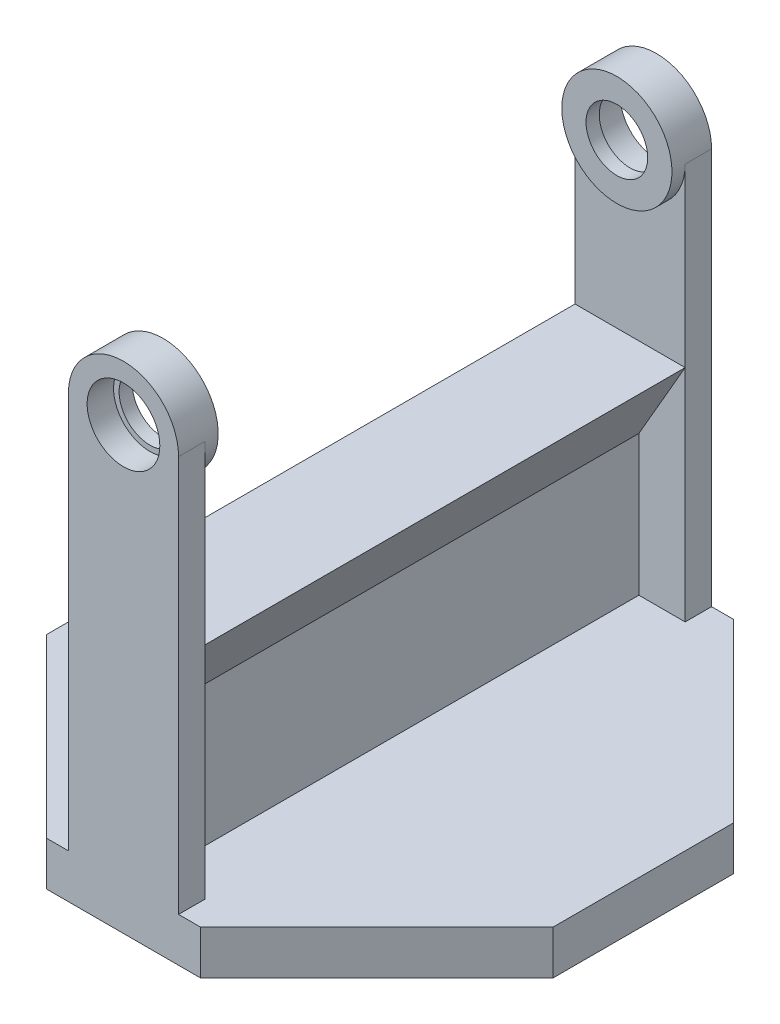
ISO-10303-21;
HEADER;
FILE_DESCRIPTION(('STEP AP214'),'2;1');
FILE_NAME('part.step','',(''),(''),'','','');
FILE_SCHEMA(('AUTOMOTIVE_DESIGN { 1 0 10303 214 1 1 1 1 }'));
ENDSEC;
DATA;
#1=APPLICATION_CONTEXT('core data for automotive mechanical design processes');
#2=APPLICATION_PROTOCOL_DEFINITION('international standard','automotive_design',2000,#1);
#3=PRODUCT_CONTEXT('',#1,'mechanical');
#4=PRODUCT('Part','Part','',(#3));
#5=PRODUCT_RELATED_PRODUCT_CATEGORY('part','',(#4));
#6=PRODUCT_DEFINITION_FORMATION('','',#4);
#7=PRODUCT_DEFINITION_CONTEXT('part definition',#1,'design');
#8=PRODUCT_DEFINITION('design','',#6,#7);
#9=PRODUCT_DEFINITION_SHAPE('','',#8);
#10=(LENGTH_UNIT() NAMED_UNIT(*) SI_UNIT(.MILLI.,.METRE.));
#11=(NAMED_UNIT(*) PLANE_ANGLE_UNIT() SI_UNIT($,.RADIAN.));
#12=(NAMED_UNIT(*) SI_UNIT($,.STERADIAN.) SOLID_ANGLE_UNIT());
#13=UNCERTAINTY_MEASURE_WITH_UNIT(LENGTH_MEASURE(1.E-05),#10,'distance_accuracy_value','');
#14=(GEOMETRIC_REPRESENTATION_CONTEXT(3) GLOBAL_UNCERTAINTY_ASSIGNED_CONTEXT((#13)) GLOBAL_UNIT_ASSIGNED_CONTEXT((#10,
#11,#12)) REPRESENTATION_CONTEXT('',''));
#15=CARTESIAN_POINT('',(0.,0.,0.));
#16=DIRECTION('',(0.,0.,1.));
#17=DIRECTION('',(1.,0.,0.));
#18=AXIS2_PLACEMENT_3D('',#15,#16,#17);
#19=CARTESIAN_POINT('',(0.,100.,54.5));
#20=DIRECTION('',(0.,0.,1.));
#21=DIRECTION('',(1.,0.,0.));
#22=AXIS2_PLACEMENT_3D('',#19,#20,#21);
#23=PLANE('',#22);
#24=DIRECTION('',(0.500000000000001,-0.866025403784438,0.));
#25=VECTOR('',#24,1.);
#26=CARTESIAN_POINT('',(-12.5,60.,54.5));
#27=LINE('',#26,#25);
#28=CARTESIAN_POINT('',(-12.5,60.,54.5));
#29=VERTEX_POINT('',#28);
#30=CARTESIAN_POINT('',(-1.99999999999997,41.8134665205268,54.5));
#31=VERTEX_POINT('',#30);
#32=EDGE_CURVE('E201',#29,#31,#27,.T.);
#33=ORIENTED_EDGE('',*,*,#32,.T.);
#34=DIRECTION('',(0.,-1.,0.));
#35=VECTOR('',#34,1.);
#36=CARTESIAN_POINT('',(-2.,10.,54.5));
#37=LINE('',#36,#35);
#38=CARTESIAN_POINT('',(-2.,10.,54.5));
#39=VERTEX_POINT('',#38);
#40=EDGE_CURVE('E214',#31,#39,#37,.T.);
#41=ORIENTED_EDGE('',*,*,#40,.T.);
#42=DIRECTION('',(-1.,0.,0.));
#43=VECTOR('',#42,1.);
#44=CARTESIAN_POINT('',(0.,10.,54.5));
#45=LINE('',#44,#43);
#46=CARTESIAN_POINT('',(-12.5,10.,54.5));
#47=VERTEX_POINT('',#46);
#48=EDGE_CURVE('E282',#39,#47,#45,.T.);
#49=ORIENTED_EDGE('',*,*,#48,.T.);
#50=DIRECTION('',(0.,-1.,0.));
#51=VECTOR('',#50,1.);
#52=CARTESIAN_POINT('',(-12.5,100.,54.5));
#53=LINE('',#52,#51);
#54=EDGE_CURVE('E216',#29,#47,#53,.T.);
#55=ORIENTED_EDGE('',*,*,#54,.F.);
#56=EDGE_LOOP('',(#33,#41,#49,#55));
#57=FACE_BOUND('',#56,.T.);
#58=ADVANCED_FACE('F46',(#57),#23,.F.);
#59=DIRECTION('',(1.,0.,0.));
#60=VECTOR('',#59,1.);
#61=CARTESIAN_POINT('',(-2.,60.,54.5));
#62=LINE('',#61,#60);
#63=CARTESIAN_POINT('',(12.5,60.,54.5));
#64=VERTEX_POINT('',#63);
#65=EDGE_CURVE('E225',#29,#64,#62,.T.);
#66=ORIENTED_EDGE('',*,*,#65,.F.);
#67=CARTESIAN_POINT('',(-12.5,100.,54.5));
#68=VERTEX_POINT('',#67);
#69=EDGE_CURVE('E259',#68,#29,#53,.T.);
#70=ORIENTED_EDGE('',*,*,#69,.F.);
#71=CARTESIAN_POINT('',(0.,100.,54.5));
#72=DIRECTION('',(0.,0.,-1.));
#73=DIRECTION('',(-1.,0.,0.));
#74=AXIS2_PLACEMENT_3D('',#71,#72,#73);
#75=CIRCLE('',#74,12.5);
#76=CARTESIAN_POINT('',(12.5,100.,54.5));
#77=VERTEX_POINT('',#76);
#78=EDGE_CURVE('E248',#77,#68,#75,.T.);
#79=ORIENTED_EDGE('',*,*,#78,.F.);
#80=DIRECTION('',(0.,1.,0.));
#81=VECTOR('',#80,1.);
#82=CARTESIAN_POINT('',(12.5,100.,54.5));
#83=LINE('',#82,#81);
#84=EDGE_CURVE('E262',#64,#77,#83,.T.);
#85=ORIENTED_EDGE('',*,*,#84,.F.);
#86=EDGE_LOOP('',(#66,#70,#79,#85));
#87=FACE_BOUND('',#86,.T.);
#88=ADVANCED_FACE('F670',(#87),#23,.F.);
#89=CARTESIAN_POINT('',(0.,100.,-54.5));
#90=DIRECTION('',(0.,0.,-1.));
#91=DIRECTION('',(1.,0.,0.));
#92=AXIS2_PLACEMENT_3D('',#89,#90,#91);
#93=PLANE('',#92);
#94=DIRECTION('',(0.500000000000001,-0.866025403784438,0.));
#95=VECTOR('',#94,1.);
#96=CARTESIAN_POINT('',(-12.5,60.,-54.5));
#97=LINE('',#96,#95);
#98=CARTESIAN_POINT('',(-12.5,60.,-54.5));
#99=VERTEX_POINT('',#98);
#100=CARTESIAN_POINT('',(-1.99999999999997,41.8134665205268,-54.5));
#101=VERTEX_POINT('',#100);
#102=EDGE_CURVE('E204',#99,#101,#97,.T.);
#103=ORIENTED_EDGE('',*,*,#102,.F.);
#104=DIRECTION('',(0.,-1.,0.));
#105=VECTOR('',#104,1.);
#106=CARTESIAN_POINT('',(-12.5,100.,-54.5));
#107=LINE('',#106,#105);
#108=CARTESIAN_POINT('',(-12.5,10.,-54.5));
#109=VERTEX_POINT('',#108);
#110=EDGE_CURVE('E539',#99,#109,#107,.T.);
#111=ORIENTED_EDGE('',*,*,#110,.T.);
#112=DIRECTION('',(1.,0.,0.));
#113=VECTOR('',#112,1.);
#114=CARTESIAN_POINT('',(0.,10.,-54.5));
#115=LINE('',#114,#113);
#116=CARTESIAN_POINT('',(-2.,10.,-54.5));
#117=VERTEX_POINT('',#116);
#118=EDGE_CURVE('E511',#109,#117,#115,.T.);
#119=ORIENTED_EDGE('',*,*,#118,.T.);
#120=DIRECTION('',(0.,-1.,0.));
#121=VECTOR('',#120,1.);
#122=CARTESIAN_POINT('',(-2.,10.,-54.5));
#123=LINE('',#122,#121);
#124=EDGE_CURVE('E601',#101,#117,#123,.T.);
#125=ORIENTED_EDGE('',*,*,#124,.F.);
#126=EDGE_LOOP('',(#103,#111,#119,#125));
#127=FACE_BOUND('',#126,.T.);
#128=ADVANCED_FACE('F649',(#127),#93,.F.);
#129=CARTESIAN_POINT('',(-12.5,100.,-54.5));
#130=VERTEX_POINT('',#129);
#131=EDGE_CURVE('E533',#130,#99,#107,.T.);
#132=ORIENTED_EDGE('',*,*,#131,.T.);
#133=DIRECTION('',(1.,0.,0.));
#134=VECTOR('',#133,1.);
#135=CARTESIAN_POINT('',(-2.,60.,-54.5));
#136=LINE('',#135,#134);
#137=CARTESIAN_POINT('',(12.5,60.,-54.5));
#138=VERTEX_POINT('',#137);
#139=EDGE_CURVE('E596',#99,#138,#136,.T.);
#140=ORIENTED_EDGE('',*,*,#139,.T.);
#141=DIRECTION('',(0.,1.,0.));
#142=VECTOR('',#141,1.);
#143=CARTESIAN_POINT('',(12.5,100.,-54.5));
#144=LINE('',#143,#142);
#145=CARTESIAN_POINT('',(12.5,100.,-54.5));
#146=VERTEX_POINT('',#145);
#147=EDGE_CURVE('E547',#138,#146,#144,.T.);
#148=ORIENTED_EDGE('',*,*,#147,.T.);
#149=CARTESIAN_POINT('',(0.,100.,-54.5));
#150=DIRECTION('',(0.,0.,-1.));
#151=DIRECTION('',(-1.,0.,0.));
#152=AXIS2_PLACEMENT_3D('',#149,#150,#151);
#153=CIRCLE('',#152,12.5);
#154=EDGE_CURVE('E572',#146,#130,#153,.T.);
#155=ORIENTED_EDGE('',*,*,#154,.T.);
#156=EDGE_LOOP('',(#132,#140,#148,#155));
#157=FACE_BOUND('',#156,.T.);
#158=ADVANCED_FACE('F656',(#157),#93,.F.);
#159=CARTESIAN_POINT('',(-2.,0.,0.));
#160=DIRECTION('',(-1.,0.,0.));
#161=DIRECTION('',(0.,0.,1.));
#162=AXIS2_PLACEMENT_3D('',#159,#160,#161);
#163=PLANE('',#162);
#164=ORIENTED_EDGE('',*,*,#40,.F.);
#165=DIRECTION('',(0.,0.,-1.));
#166=VECTOR('',#165,1.);
#167=CARTESIAN_POINT('',(-1.99999999999997,41.8134665205268,60.502));
#168=LINE('',#167,#166);
#169=EDGE_CURVE('E197',#31,#101,#168,.T.);
#170=ORIENTED_EDGE('',*,*,#169,.T.);
#171=ORIENTED_EDGE('',*,*,#124,.T.);
#172=DIRECTION('',(0.,0.,-1.));
#173=VECTOR('',#172,1.);
#174=CARTESIAN_POINT('',(-2.,10.,0.));
#175=LINE('',#174,#173);
#176=EDGE_CURVE('E223',#39,#117,#175,.T.);
#177=ORIENTED_EDGE('',*,*,#176,.F.);
#178=EDGE_LOOP('',(#164,#170,#171,#177));
#179=FACE_BOUND('',#178,.T.);
#180=ADVANCED_FACE('F221',(#179),#163,.T.);
#181=DIRECTION('',(0.500000000000001,0.866025403784438,0.));
#182=VECTOR('',#181,1.);
#183=CARTESIAN_POINT('',(12.5,60.,54.5));
#184=LINE('',#183,#182);
#185=CARTESIAN_POINT('',(2.,41.8134665205268,54.5));
#186=VERTEX_POINT('',#185);
#187=EDGE_CURVE('E628',#186,#64,#184,.T.);
#188=ORIENTED_EDGE('',*,*,#187,.T.);
#189=CARTESIAN_POINT('',(12.5,10.,54.5));
#190=VERTEX_POINT('',#189);
#191=EDGE_CURVE('E263',#190,#64,#83,.T.);
#192=ORIENTED_EDGE('',*,*,#191,.F.);
#193=CARTESIAN_POINT('',(2.,10.,54.5));
#194=VERTEX_POINT('',#193);
#195=EDGE_CURVE('E285',#190,#194,#45,.T.);
#196=ORIENTED_EDGE('',*,*,#195,.T.);
#197=DIRECTION('',(0.,-1.,0.));
#198=VECTOR('',#197,1.);
#199=CARTESIAN_POINT('',(2.,10.,54.5));
#200=LINE('',#199,#198);
#201=EDGE_CURVE('E232',#186,#194,#200,.T.);
#202=ORIENTED_EDGE('',*,*,#201,.F.);
#203=EDGE_LOOP('',(#188,#192,#196,#202));
#204=FACE_BOUND('',#203,.T.);
#205=ADVANCED_FACE('F679',(#204),#23,.F.);
#206=CARTESIAN_POINT('',(2.,0.,0.));
#207=DIRECTION('',(-1.,0.,0.));
#208=DIRECTION('',(0.,0.,1.));
#209=AXIS2_PLACEMENT_3D('',#206,#207,#208);
#210=PLANE('',#209);
#211=DIRECTION('',(0.,0.,-1.));
#212=VECTOR('',#211,1.);
#213=CARTESIAN_POINT('',(2.,41.8134665205268,60.502));
#214=LINE('',#213,#212);
#215=CARTESIAN_POINT('',(2.,41.8134665205268,-54.5));
#216=VERTEX_POINT('',#215);
#217=EDGE_CURVE('E622',#186,#216,#214,.T.);
#218=ORIENTED_EDGE('',*,*,#217,.F.);
#219=ORIENTED_EDGE('',*,*,#201,.T.);
#220=DIRECTION('',(0.,0.,-1.));
#221=VECTOR('',#220,1.);
#222=CARTESIAN_POINT('',(2.,10.,0.));
#223=LINE('',#222,#221);
#224=CARTESIAN_POINT('',(2.,10.,-54.5));
#225=VERTEX_POINT('',#224);
#226=EDGE_CURVE('E494',#194,#225,#223,.T.);
#227=ORIENTED_EDGE('',*,*,#226,.T.);
#228=DIRECTION('',(0.,-1.,0.));
#229=VECTOR('',#228,1.);
#230=CARTESIAN_POINT('',(2.,10.,-54.5));
#231=LINE('',#230,#229);
#232=EDGE_CURVE('E605',#216,#225,#231,.T.);
#233=ORIENTED_EDGE('',*,*,#232,.F.);
#234=EDGE_LOOP('',(#218,#219,#227,#233));
#235=FACE_BOUND('',#234,.T.);
#236=ADVANCED_FACE('F687',(#235),#210,.F.);
#237=DIRECTION('',(0.500000000000001,0.866025403784438,0.));
#238=VECTOR('',#237,1.);
#239=CARTESIAN_POINT('',(12.5,60.,-54.5));
#240=LINE('',#239,#238);
#241=EDGE_CURVE('E609',#216,#138,#240,.T.);
#242=ORIENTED_EDGE('',*,*,#241,.F.);
#243=ORIENTED_EDGE('',*,*,#232,.T.);
#244=CARTESIAN_POINT('',(12.5,10.,-54.5));
#245=VERTEX_POINT('',#244);
#246=EDGE_CURVE('E517',#225,#245,#115,.T.);
#247=ORIENTED_EDGE('',*,*,#246,.T.);
#248=EDGE_CURVE('E542',#245,#138,#144,.T.);
#249=ORIENTED_EDGE('',*,*,#248,.T.);
#250=EDGE_LOOP('',(#242,#243,#247,#249));
#251=FACE_BOUND('',#250,.T.);
#252=ADVANCED_FACE('F684',(#251),#93,.F.);
#253=CARTESIAN_POINT('',(0.,10.,0.));
#254=DIRECTION('',(0.,-1.,0.));
#255=DIRECTION('',(0.,0.,-1.));
#256=AXIS2_PLACEMENT_3D('',#253,#254,#255);
#257=PLANE('',#256);
#258=DIRECTION('',(0.,0.,-1.));
#259=VECTOR('',#258,1.);
#260=CARTESIAN_POINT('',(57.5,10.,60.5));
#261=LINE('',#260,#259);
#262=CARTESIAN_POINT('',(57.5,10.,20.5));
#263=VERTEX_POINT('',#262);
#264=CARTESIAN_POINT('',(57.5,10.,-20.4999999999999));
#265=VERTEX_POINT('',#264);
#266=EDGE_CURVE('E298',#263,#265,#261,.T.);
#267=ORIENTED_EDGE('',*,*,#266,.T.);
#268=DIRECTION('',(0.707106781186547,0.,0.707106781186548));
#269=VECTOR('',#268,1.);
#270=CARTESIAN_POINT('',(17.5,10.,-60.5));
#271=LINE('',#270,#269);
#272=CARTESIAN_POINT('',(17.5,10.,-60.5));
#273=VERTEX_POINT('',#272);
#274=EDGE_CURVE('E362',#265,#273,#271,.F.);
#275=ORIENTED_EDGE('',*,*,#274,.T.);
#276=DIRECTION('',(-1.,0.,0.));
#277=VECTOR('',#276,1.);
#278=CARTESIAN_POINT('',(-57.5,10.,-60.5));
#279=LINE('',#278,#277);
#280=CARTESIAN_POINT('',(12.5,10.,-60.5));
#281=VERTEX_POINT('',#280);
#282=EDGE_CURVE('E304',#273,#281,#279,.T.);
#283=ORIENTED_EDGE('',*,*,#282,.T.);
#284=DIRECTION('',(0.,0.,-1.));
#285=VECTOR('',#284,1.);
#286=CARTESIAN_POINT('',(12.5,10.,0.));
#287=LINE('',#286,#285);
#288=EDGE_CURVE('E505',#245,#281,#287,.T.);
#289=ORIENTED_EDGE('',*,*,#288,.F.);
#290=ORIENTED_EDGE('',*,*,#246,.F.);
#291=ORIENTED_EDGE('',*,*,#226,.F.);
#292=ORIENTED_EDGE('',*,*,#195,.F.);
#293=DIRECTION('',(0.,0.,1.));
#294=VECTOR('',#293,1.);
#295=CARTESIAN_POINT('',(12.5,10.,0.));
#296=LINE('',#295,#294);
#297=CARTESIAN_POINT('',(12.5,9.99999999999999,60.5));
#298=VERTEX_POINT('',#297);
#299=EDGE_CURVE('E293',#190,#298,#296,.T.);
#300=ORIENTED_EDGE('',*,*,#299,.T.);
#301=DIRECTION('',(1.,0.,0.));
#302=VECTOR('',#301,1.);
#303=CARTESIAN_POINT('',(-57.5,10.,60.5));
#304=LINE('',#303,#302);
#305=CARTESIAN_POINT('',(17.4999999999999,10.,60.5));
#306=VERTEX_POINT('',#305);
#307=EDGE_CURVE('E310',#298,#306,#304,.T.);
#308=ORIENTED_EDGE('',*,*,#307,.T.);
#309=DIRECTION('',(-0.707106781186548,0.,0.707106781186547));
#310=VECTOR('',#309,1.);
#311=CARTESIAN_POINT('',(57.5,10.,20.5));
#312=LINE('',#311,#310);
#313=EDGE_CURVE('E359',#306,#263,#312,.F.);
#314=ORIENTED_EDGE('',*,*,#313,.T.);
#315=EDGE_LOOP('',(#267,#275,#283,#289,#290,#291,#292,#300,#308,#314));
#316=FACE_BOUND('',#315,.T.);
#317=ADVANCED_FACE('F417',(#316),#257,.F.);
#318=CARTESIAN_POINT('',(-12.5,9.99999999999999,-60.5));
#319=VERTEX_POINT('',#318);
#320=CARTESIAN_POINT('',(-17.4999999999999,10.,-60.5));
#321=VERTEX_POINT('',#320);
#322=EDGE_CURVE('E302',#319,#321,#279,.T.);
#323=ORIENTED_EDGE('',*,*,#322,.T.);
#324=DIRECTION('',(0.707106781186548,0.,-0.707106781186547));
#325=VECTOR('',#324,1.);
#326=CARTESIAN_POINT('',(-57.5,10.,-20.5));
#327=LINE('',#326,#325);
#328=CARTESIAN_POINT('',(-57.5,10.,-20.5));
#329=VERTEX_POINT('',#328);
#330=EDGE_CURVE('E11',#321,#329,#327,.F.);
#331=ORIENTED_EDGE('',*,*,#330,.T.);
#332=DIRECTION('',(0.,0.,1.));
#333=VECTOR('',#332,1.);
#334=CARTESIAN_POINT('',(-57.5,10.,60.5));
#335=LINE('',#334,#333);
#336=CARTESIAN_POINT('',(-57.5,10.,20.4999999999999));
#337=VERTEX_POINT('',#336);
#338=EDGE_CURVE('E307',#329,#337,#335,.T.);
#339=ORIENTED_EDGE('',*,*,#338,.T.);
#340=DIRECTION('',(-0.707106781186547,0.,-0.707106781186548));
#341=VECTOR('',#340,1.);
#342=CARTESIAN_POINT('',(-17.5,10.,60.5));
#343=LINE('',#342,#341);
#344=CARTESIAN_POINT('',(-17.5,10.,60.5));
#345=VERTEX_POINT('',#344);
#346=EDGE_CURVE('E56',#337,#345,#343,.F.);
#347=ORIENTED_EDGE('',*,*,#346,.T.);
#348=CARTESIAN_POINT('',(-12.5,10.,60.5));
#349=VERTEX_POINT('',#348);
#350=EDGE_CURVE('E311',#345,#349,#304,.T.);
#351=ORIENTED_EDGE('',*,*,#350,.T.);
#352=DIRECTION('',(0.,0.,-1.));
#353=VECTOR('',#352,1.);
#354=CARTESIAN_POINT('',(-12.5,10.,0.));
#355=LINE('',#354,#353);
#356=EDGE_CURVE('E289',#349,#47,#355,.T.);
#357=ORIENTED_EDGE('',*,*,#356,.T.);
#358=ORIENTED_EDGE('',*,*,#48,.F.);
#359=ORIENTED_EDGE('',*,*,#176,.T.);
#360=ORIENTED_EDGE('',*,*,#118,.F.);
#361=DIRECTION('',(0.,0.,1.));
#362=VECTOR('',#361,1.);
#363=CARTESIAN_POINT('',(-12.5,10.,0.));
#364=LINE('',#363,#362);
#365=EDGE_CURVE('E499',#319,#109,#364,.T.);
#366=ORIENTED_EDGE('',*,*,#365,.F.);
#367=EDGE_LOOP('',(#323,#331,#339,#347,#351,#357,#358,#359,#360,#366));
#368=FACE_BOUND('',#367,.T.);
#369=ADVANCED_FACE('F380',(#368),#257,.F.);
#370=CARTESIAN_POINT('',(57.5,10.,60.5));
#371=DIRECTION('',(-1.,0.,0.));
#372=DIRECTION('',(0.,0.,1.));
#373=AXIS2_PLACEMENT_3D('',#370,#371,#372);
#374=PLANE('',#373);
#375=DIRECTION('',(0.,0.,-1.));
#376=VECTOR('',#375,1.);
#377=CARTESIAN_POINT('',(57.5,0.,60.5));
#378=LINE('',#377,#376);
#379=CARTESIAN_POINT('',(57.5,0.,20.5));
#380=VERTEX_POINT('',#379);
#381=CARTESIAN_POINT('',(57.5,0.,-20.4999999999999));
#382=VERTEX_POINT('',#381);
#383=EDGE_CURVE('E297',#380,#382,#378,.T.);
#384=ORIENTED_EDGE('',*,*,#383,.T.);
#385=DIRECTION('',(0.,1.,0.));
#386=VECTOR('',#385,1.);
#387=CARTESIAN_POINT('',(57.5,10.,-20.4999999999999));
#388=LINE('',#387,#386);
#389=EDGE_CURVE('E356',#382,#265,#388,.T.);
#390=ORIENTED_EDGE('',*,*,#389,.T.);
#391=ORIENTED_EDGE('',*,*,#266,.F.);
#392=DIRECTION('',(0.,-1.,0.));
#393=VECTOR('',#392,1.);
#394=CARTESIAN_POINT('',(57.5,10.,20.5));
#395=LINE('',#394,#393);
#396=EDGE_CURVE('E352',#263,#380,#395,.T.);
#397=ORIENTED_EDGE('',*,*,#396,.T.);
#398=EDGE_LOOP('',(#384,#390,#391,#397));
#399=FACE_BOUND('',#398,.T.);
#400=ADVANCED_FACE('F408',(#399),#374,.F.);
#401=CARTESIAN_POINT('',(-57.5,10.,-60.5));
#402=DIRECTION('',(0.,0.,1.));
#403=DIRECTION('',(1.,0.,0.));
#404=AXIS2_PLACEMENT_3D('',#401,#402,#403);
#405=PLANE('',#404);
#406=CARTESIAN_POINT('',(0.,100.,-60.5));
#407=DIRECTION('',(0.,0.,1.));
#408=DIRECTION('',(1.,0.,0.));
#409=AXIS2_PLACEMENT_3D('',#406,#407,#408);
#410=CIRCLE('',#409,8.25000000000001);
#411=CARTESIAN_POINT('',(8.25000000000001,100.,-60.5));
#412=VERTEX_POINT('',#411);
#413=EDGE_CURVE('E590',#412,#412,#410,.T.);
#414=ORIENTED_EDGE('',*,*,#413,.T.);
#415=EDGE_LOOP('',(#414));
#416=FACE_BOUND('',#415,.T.);
#417=ORIENTED_EDGE('',*,*,#282,.F.);
#418=DIRECTION('',(0.,-1.,0.));
#419=VECTOR('',#418,1.);
#420=CARTESIAN_POINT('',(17.5,10.,-60.5));
#421=LINE('',#420,#419);
#422=CARTESIAN_POINT('',(17.5,0.,-60.5));
#423=VERTEX_POINT('',#422);
#424=EDGE_CURVE('E336',#273,#423,#421,.T.);
#425=ORIENTED_EDGE('',*,*,#424,.T.);
#426=DIRECTION('',(-1.,0.,0.));
#427=VECTOR('',#426,1.);
#428=CARTESIAN_POINT('',(-57.5,0.,-60.5));
#429=LINE('',#428,#427);
#430=CARTESIAN_POINT('',(-17.4999999999999,0.,-60.5));
#431=VERTEX_POINT('',#430);
#432=EDGE_CURVE('E318',#423,#431,#429,.T.);
#433=ORIENTED_EDGE('',*,*,#432,.T.);
#434=DIRECTION('',(0.,1.,0.));
#435=VECTOR('',#434,1.);
#436=CARTESIAN_POINT('',(-17.4999999999999,10.,-60.5));
#437=LINE('',#436,#435);
#438=EDGE_CURVE('E314',#431,#321,#437,.T.);
#439=ORIENTED_EDGE('',*,*,#438,.T.);
#440=ORIENTED_EDGE('',*,*,#322,.F.);
#441=DIRECTION('',(0.,-1.,0.));
#442=VECTOR('',#441,1.);
#443=CARTESIAN_POINT('',(-12.5,100.,-60.5));
#444=LINE('',#443,#442);
#445=CARTESIAN_POINT('',(-12.5,100.,-60.5));
#446=VERTEX_POINT('',#445);
#447=EDGE_CURVE('E550',#446,#319,#444,.T.);
#448=ORIENTED_EDGE('',*,*,#447,.F.);
#449=CARTESIAN_POINT('',(0.,100.,-60.5));
#450=DIRECTION('',(0.,0.,1.));
#451=DIRECTION('',(1.,0.,0.));
#452=AXIS2_PLACEMENT_3D('',#449,#450,#451);
#453=CIRCLE('',#452,12.5);
#454=CARTESIAN_POINT('',(12.5,100.,-60.5));
#455=VERTEX_POINT('',#454);
#456=EDGE_CURVE('E560',#455,#446,#453,.T.);
#457=ORIENTED_EDGE('',*,*,#456,.F.);
#458=DIRECTION('',(0.,1.,0.));
#459=VECTOR('',#458,1.);
#460=CARTESIAN_POINT('',(12.5,100.,-60.5));
#461=LINE('',#460,#459);
#462=EDGE_CURVE('E555',#281,#455,#461,.T.);
#463=ORIENTED_EDGE('',*,*,#462,.F.);
#464=EDGE_LOOP('',(#417,#425,#433,#439,#440,#448,#457,#463));
#465=FACE_BOUND('',#464,.T.);
#466=ADVANCED_FACE('F399',(#416,#465),#405,.F.);
#467=CARTESIAN_POINT('',(-57.5,10.,60.5));
#468=DIRECTION('',(1.,0.,0.));
#469=DIRECTION('',(0.,0.,-1.));
#470=AXIS2_PLACEMENT_3D('',#467,#468,#469);
#471=PLANE('',#470);
#472=ORIENTED_EDGE('',*,*,#338,.F.);
#473=DIRECTION('',(0.,-1.,0.));
#474=VECTOR('',#473,1.);
#475=CARTESIAN_POINT('',(-57.5,10.,-20.5));
#476=LINE('',#475,#474);
#477=CARTESIAN_POINT('',(-57.5,0.,-20.5));
#478=VERTEX_POINT('',#477);
#479=EDGE_CURVE('E374',#329,#478,#476,.T.);
#480=ORIENTED_EDGE('',*,*,#479,.T.);
#481=DIRECTION('',(0.,0.,1.));
#482=VECTOR('',#481,1.);
#483=CARTESIAN_POINT('',(-57.5,0.,60.5));
#484=LINE('',#483,#482);
#485=CARTESIAN_POINT('',(-57.5,0.,20.4999999999999));
#486=VERTEX_POINT('',#485);
#487=EDGE_CURVE('E322',#478,#486,#484,.T.);
#488=ORIENTED_EDGE('',*,*,#487,.T.);
#489=DIRECTION('',(0.,1.,0.));
#490=VECTOR('',#489,1.);
#491=CARTESIAN_POINT('',(-57.5,10.,20.4999999999999));
#492=LINE('',#491,#490);
#493=EDGE_CURVE('E63',#486,#337,#492,.T.);
#494=ORIENTED_EDGE('',*,*,#493,.T.);
#495=EDGE_LOOP('',(#472,#480,#488,#494));
#496=FACE_BOUND('',#495,.T.);
#497=ADVANCED_FACE('F392',(#496),#471,.F.);
#498=CARTESIAN_POINT('',(-57.5,10.,60.5));
#499=DIRECTION('',(0.,0.,-1.));
#500=DIRECTION('',(-1.,0.,0.));
#501=AXIS2_PLACEMENT_3D('',#498,#499,#500);
#502=PLANE('',#501);
#503=CARTESIAN_POINT('',(0.,100.,60.5));
#504=DIRECTION('',(0.,0.,1.));
#505=DIRECTION('',(1.,0.,0.));
#506=AXIS2_PLACEMENT_3D('',#503,#504,#505);
#507=CIRCLE('',#506,8.25000000000001);
#508=CARTESIAN_POINT('',(8.25000000000001,100.,60.5));
#509=VERTEX_POINT('',#508);
#510=EDGE_CURVE('E230',#509,#509,#507,.T.);
#511=ORIENTED_EDGE('',*,*,#510,.F.);
#512=EDGE_LOOP('',(#511));
#513=FACE_BOUND('',#512,.T.);
#514=DIRECTION('',(1.,0.,0.));
#515=VECTOR('',#514,1.);
#516=CARTESIAN_POINT('',(-57.5,0.,60.5));
#517=LINE('',#516,#515);
#518=CARTESIAN_POINT('',(-17.5,0.,60.5));
#519=VERTEX_POINT('',#518);
#520=CARTESIAN_POINT('',(17.4999999999999,0.,60.5));
#521=VERTEX_POINT('',#520);
#522=EDGE_CURVE('E303',#519,#521,#517,.T.);
#523=ORIENTED_EDGE('',*,*,#522,.T.);
#524=DIRECTION('',(0.,1.,0.));
#525=VECTOR('',#524,1.);
#526=CARTESIAN_POINT('',(17.4999999999999,10.,60.5));
#527=LINE('',#526,#525);
#528=EDGE_CURVE('E369',#521,#306,#527,.T.);
#529=ORIENTED_EDGE('',*,*,#528,.T.);
#530=ORIENTED_EDGE('',*,*,#307,.F.);
#531=DIRECTION('',(0.,1.,0.));
#532=VECTOR('',#531,1.);
#533=CARTESIAN_POINT('',(12.5,100.,60.5));
#534=LINE('',#533,#532);
#535=CARTESIAN_POINT('',(12.5,100.,60.5));
#536=VERTEX_POINT('',#535);
#537=EDGE_CURVE('E275',#298,#536,#534,.T.);
#538=ORIENTED_EDGE('',*,*,#537,.T.);
#539=CARTESIAN_POINT('',(0.,100.,60.5));
#540=DIRECTION('',(0.,0.,1.));
#541=DIRECTION('',(1.,0.,0.));
#542=AXIS2_PLACEMENT_3D('',#539,#540,#541);
#543=CIRCLE('',#542,12.5);
#544=CARTESIAN_POINT('',(-12.5,100.,60.5));
#545=VERTEX_POINT('',#544);
#546=EDGE_CURVE('E256',#536,#545,#543,.T.);
#547=ORIENTED_EDGE('',*,*,#546,.T.);
#548=DIRECTION('',(0.,-1.,0.));
#549=VECTOR('',#548,1.);
#550=CARTESIAN_POINT('',(-12.5,100.,60.5));
#551=LINE('',#550,#549);
#552=EDGE_CURVE('E271',#545,#349,#551,.T.);
#553=ORIENTED_EDGE('',*,*,#552,.T.);
#554=ORIENTED_EDGE('',*,*,#350,.F.);
#555=DIRECTION('',(0.,-1.,0.));
#556=VECTOR('',#555,1.);
#557=CARTESIAN_POINT('',(-17.5,10.,60.5));
#558=LINE('',#557,#556);
#559=EDGE_CURVE('E365',#345,#519,#558,.T.);
#560=ORIENTED_EDGE('',*,*,#559,.T.);
#561=EDGE_LOOP('',(#523,#529,#530,#538,#547,#553,#554,#560));
#562=FACE_BOUND('',#561,.T.);
#563=ADVANCED_FACE('F385',(#513,#562),#502,.F.);
#564=CARTESIAN_POINT('',(0.,0.,0.));
#565=DIRECTION('',(0.,-1.,0.));
#566=DIRECTION('',(0.,0.,-1.));
#567=AXIS2_PLACEMENT_3D('',#564,#565,#566);
#568=PLANE('',#567);
#569=ORIENTED_EDGE('',*,*,#432,.F.);
#570=DIRECTION('',(-0.707106781186547,0.,-0.707106781186548));
#571=VECTOR('',#570,1.);
#572=CARTESIAN_POINT('',(39.,0.,-38.9999999999999));
#573=LINE('',#572,#571);
#574=EDGE_CURVE('E349',#423,#382,#573,.F.);
#575=ORIENTED_EDGE('',*,*,#574,.T.);
#576=ORIENTED_EDGE('',*,*,#383,.F.);
#577=DIRECTION('',(0.707106781186548,0.,-0.707106781186547));
#578=VECTOR('',#577,1.);
#579=CARTESIAN_POINT('',(38.9999999999999,0.,39.));
#580=LINE('',#579,#578);
#581=EDGE_CURVE('E346',#380,#521,#580,.F.);
#582=ORIENTED_EDGE('',*,*,#581,.T.);
#583=ORIENTED_EDGE('',*,*,#522,.F.);
#584=DIRECTION('',(0.707106781186547,0.,0.707106781186548));
#585=VECTOR('',#584,1.);
#586=CARTESIAN_POINT('',(-39.,0.,38.9999999999999));
#587=LINE('',#586,#585);
#588=EDGE_CURVE('E340',#519,#486,#587,.F.);
#589=ORIENTED_EDGE('',*,*,#588,.T.);
#590=ORIENTED_EDGE('',*,*,#487,.F.);
#591=DIRECTION('',(-0.707106781186548,0.,0.707106781186547));
#592=VECTOR('',#591,1.);
#593=CARTESIAN_POINT('',(-38.9999999999999,0.,-39.));
#594=LINE('',#593,#592);
#595=EDGE_CURVE('E343',#478,#431,#594,.F.);
#596=ORIENTED_EDGE('',*,*,#595,.T.);
#597=EDGE_LOOP('',(#569,#575,#576,#582,#583,#589,#590,#596));
#598=FACE_BOUND('',#597,.T.);
#599=ADVANCED_FACE('F391',(#598),#568,.T.);
#600=CARTESIAN_POINT('',(12.5,100.,54.5));
#601=DIRECTION('',(1.,0.,0.));
#602=DIRECTION('',(0.,1.,0.));
#603=AXIS2_PLACEMENT_3D('',#600,#601,#602);
#604=PLANE('',#603);
#605=ORIENTED_EDGE('',*,*,#299,.F.);
#606=ORIENTED_EDGE('',*,*,#191,.T.);
#607=ORIENTED_EDGE('',*,*,#84,.T.);
#608=DIRECTION('',(0.,0.,1.));
#609=VECTOR('',#608,1.);
#610=CARTESIAN_POINT('',(12.5,100.,54.5));
#611=LINE('',#610,#609);
#612=EDGE_CURVE('E278',#77,#536,#611,.T.);
#613=ORIENTED_EDGE('',*,*,#612,.T.);
#614=ORIENTED_EDGE('',*,*,#537,.F.);
#615=EDGE_LOOP('',(#605,#606,#607,#613,#614));
#616=FACE_BOUND('',#615,.T.);
#617=ADVANCED_FACE('F755',(#616),#604,.T.);
#618=CARTESIAN_POINT('',(-12.5,100.,54.5));
#619=DIRECTION('',(-1.,0.,0.));
#620=DIRECTION('',(0.,-1.,0.));
#621=AXIS2_PLACEMENT_3D('',#618,#619,#620);
#622=PLANE('',#621);
#623=ORIENTED_EDGE('',*,*,#356,.F.);
#624=ORIENTED_EDGE('',*,*,#552,.F.);
#625=DIRECTION('',(0.,0.,1.));
#626=VECTOR('',#625,1.);
#627=CARTESIAN_POINT('',(-12.5,100.,54.5));
#628=LINE('',#627,#626);
#629=EDGE_CURVE('E267',#68,#545,#628,.T.);
#630=ORIENTED_EDGE('',*,*,#629,.F.);
#631=ORIENTED_EDGE('',*,*,#69,.T.);
#632=ORIENTED_EDGE('',*,*,#54,.T.);
#633=EDGE_LOOP('',(#623,#624,#630,#631,#632));
#634=FACE_BOUND('',#633,.T.);
#635=ADVANCED_FACE('F665',(#634),#622,.T.);
#636=CARTESIAN_POINT('',(0.,100.,54.5));
#637=DIRECTION('',(0.,0.,1.));
#638=DIRECTION('',(1.,0.,0.));
#639=AXIS2_PLACEMENT_3D('',#636,#637,#638);
#640=CYLINDRICAL_SURFACE('',#639,12.5);
#641=ORIENTED_EDGE('',*,*,#546,.F.);
#642=ORIENTED_EDGE('',*,*,#612,.F.);
#643=ORIENTED_EDGE('',*,*,#78,.T.);
#644=ORIENTED_EDGE('',*,*,#629,.T.);
#645=EDGE_LOOP('',(#641,#642,#643,#644));
#646=FACE_BOUND('',#645,.T.);
#647=CARTESIAN_POINT('',(0.,100.,51.5));
#648=DIRECTION('',(0.,0.,-1.));
#649=DIRECTION('',(-1.,0.,0.));
#650=AXIS2_PLACEMENT_3D('',#647,#648,#649);
#651=CIRCLE('',#650,12.5);
#652=CARTESIAN_POINT('',(-12.5,100.,51.5));
#653=VERTEX_POINT('',#652);
#654=EDGE_CURVE('E252',#653,#653,#651,.T.);
#655=ORIENTED_EDGE('',*,*,#654,.F.);
#656=EDGE_LOOP('',(#655));
#657=FACE_BOUND('',#656,.T.);
#658=ADVANCED_FACE('F738',(#646,#657),#640,.T.);
#659=CARTESIAN_POINT('',(0.,100.,51.5));
#660=DIRECTION('',(0.,0.,-1.));
#661=DIRECTION('',(-1.,0.,0.));
#662=AXIS2_PLACEMENT_3D('',#659,#660,#661);
#663=PLANE('',#662);
#664=ORIENTED_EDGE('',*,*,#654,.T.);
#665=EDGE_LOOP('',(#664));
#666=FACE_BOUND('',#665,.T.);
#667=CARTESIAN_POINT('',(0.,100.,51.5));
#668=DIRECTION('',(0.,0.,-1.));
#669=DIRECTION('',(-1.,0.,0.));
#670=AXIS2_PLACEMENT_3D('',#667,#668,#669);
#671=CIRCLE('',#670,7.00000000000001);
#672=CARTESIAN_POINT('',(-7.00000000000001,100.,51.5));
#673=VERTEX_POINT('',#672);
#674=EDGE_CURVE('E244',#673,#673,#671,.T.);
#675=ORIENTED_EDGE('',*,*,#674,.F.);
#676=EDGE_LOOP('',(#675));
#677=FACE_BOUND('',#676,.T.);
#678=ADVANCED_FACE('F735',(#666,#677),#663,.T.);
#679=CARTESIAN_POINT('',(0.,100.,51.5));
#680=DIRECTION('',(0.,0.,1.));
#681=DIRECTION('',(1.,0.,0.));
#682=AXIS2_PLACEMENT_3D('',#679,#680,#681);
#683=CYLINDRICAL_SURFACE('',#682,7.00000000000001);
#684=ORIENTED_EDGE('',*,*,#674,.T.);
#685=EDGE_LOOP('',(#684));
#686=FACE_BOUND('',#685,.T.);
#687=CARTESIAN_POINT('',(0.,100.,54.5));
#688=DIRECTION('',(0.,0.,-1.));
#689=DIRECTION('',(-1.,0.,0.));
#690=AXIS2_PLACEMENT_3D('',#687,#688,#689);
#691=CIRCLE('',#690,7.00000000000001);
#692=CARTESIAN_POINT('',(-7.00000000000001,100.,54.5));
#693=VERTEX_POINT('',#692);
#694=EDGE_CURVE('E243',#693,#693,#691,.T.);
#695=ORIENTED_EDGE('',*,*,#694,.F.);
#696=EDGE_LOOP('',(#695));
#697=FACE_BOUND('',#696,.T.);
#698=ADVANCED_FACE('F729',(#686,#697),#683,.F.);
#699=CARTESIAN_POINT('',(0.,100.,54.5));
#700=DIRECTION('',(0.,0.,1.));
#701=DIRECTION('',(1.,0.,0.));
#702=AXIS2_PLACEMENT_3D('',#699,#700,#701);
#703=PLANE('',#702);
#704=CARTESIAN_POINT('',(0.,100.,54.5));
#705=DIRECTION('',(0.,0.,1.));
#706=DIRECTION('',(1.,0.,0.));
#707=AXIS2_PLACEMENT_3D('',#704,#705,#706);
#708=CIRCLE('',#707,8.25000000000001);
#709=CARTESIAN_POINT('',(8.25000000000001,100.,54.5));
#710=VERTEX_POINT('',#709);
#711=EDGE_CURVE('E239',#710,#710,#708,.F.);
#712=ORIENTED_EDGE('',*,*,#711,.F.);
#713=EDGE_LOOP('',(#712));
#714=FACE_BOUND('',#713,.T.);
#715=ORIENTED_EDGE('',*,*,#694,.T.);
#716=EDGE_LOOP('',(#715));
#717=FACE_BOUND('',#716,.T.);
#718=ADVANCED_FACE('F726',(#714,#717),#703,.T.);
#719=CARTESIAN_POINT('',(0.,100.,31.1654762208439));
#720=DIRECTION('',(0.,0.,1.));
#721=DIRECTION('',(1.,0.,0.));
#722=AXIS2_PLACEMENT_3D('',#719,#720,#721);
#723=CYLINDRICAL_SURFACE('',#722,8.25000000000001);
#724=ORIENTED_EDGE('',*,*,#711,.T.);
#725=EDGE_LOOP('',(#724));
#726=FACE_BOUND('',#725,.T.);
#727=ORIENTED_EDGE('',*,*,#510,.T.);
#728=EDGE_LOOP('',(#727));
#729=FACE_BOUND('',#728,.T.);
#730=ADVANCED_FACE('F725',(#726,#729),#723,.F.);
#731=CARTESIAN_POINT('',(-2.,60.,0.));
#732=DIRECTION('',(0.,1.,0.));
#733=DIRECTION('',(0.,0.,1.));
#734=AXIS2_PLACEMENT_3D('',#731,#732,#733);
#735=PLANE('',#734);
#736=ORIENTED_EDGE('',*,*,#65,.T.);
#737=DIRECTION('',(0.,0.,-1.));
#738=VECTOR('',#737,1.);
#739=CARTESIAN_POINT('',(12.5,60.,60.502));
#740=LINE('',#739,#738);
#741=EDGE_CURVE('E615',#64,#138,#740,.T.);
#742=ORIENTED_EDGE('',*,*,#741,.T.);
#743=ORIENTED_EDGE('',*,*,#139,.F.);
#744=DIRECTION('',(0.,0.,-1.));
#745=VECTOR('',#744,1.);
#746=CARTESIAN_POINT('',(-12.5,60.,60.502));
#747=LINE('',#746,#745);
#748=EDGE_CURVE('E209',#29,#99,#747,.T.);
#749=ORIENTED_EDGE('',*,*,#748,.F.);
#750=EDGE_LOOP('',(#736,#742,#743,#749));
#751=FACE_BOUND('',#750,.T.);
#752=ADVANCED_FACE('F673',(#751),#735,.T.);
#753=CARTESIAN_POINT('',(-12.5,100.,-54.5));
#754=DIRECTION('',(1.,0.,0.));
#755=DIRECTION('',(0.,1.,0.));
#756=AXIS2_PLACEMENT_3D('',#753,#754,#755);
#757=PLANE('',#756);
#758=ORIENTED_EDGE('',*,*,#447,.T.);
#759=ORIENTED_EDGE('',*,*,#365,.T.);
#760=ORIENTED_EDGE('',*,*,#110,.F.);
#761=ORIENTED_EDGE('',*,*,#131,.F.);
#762=DIRECTION('',(0.,0.,-1.));
#763=VECTOR('',#762,1.);
#764=CARTESIAN_POINT('',(-12.5,100.,-54.5));
#765=LINE('',#764,#763);
#766=EDGE_CURVE('E522',#130,#446,#765,.T.);
#767=ORIENTED_EDGE('',*,*,#766,.T.);
#768=EDGE_LOOP('',(#758,#759,#760,#761,#767));
#769=FACE_BOUND('',#768,.T.);
#770=ADVANCED_FACE('F653',(#769),#757,.F.);
#771=CARTESIAN_POINT('',(12.5,100.,-54.5));
#772=DIRECTION('',(-1.,0.,0.));
#773=DIRECTION('',(0.,-1.,0.));
#774=AXIS2_PLACEMENT_3D('',#771,#772,#773);
#775=PLANE('',#774);
#776=ORIENTED_EDGE('',*,*,#248,.F.);
#777=ORIENTED_EDGE('',*,*,#288,.T.);
#778=ORIENTED_EDGE('',*,*,#462,.T.);
#779=DIRECTION('',(0.,0.,-1.));
#780=VECTOR('',#779,1.);
#781=CARTESIAN_POINT('',(12.5,100.,-54.5));
#782=LINE('',#781,#780);
#783=EDGE_CURVE('E527',#146,#455,#782,.T.);
#784=ORIENTED_EDGE('',*,*,#783,.F.);
#785=ORIENTED_EDGE('',*,*,#147,.F.);
#786=EDGE_LOOP('',(#776,#777,#778,#784,#785));
#787=FACE_BOUND('',#786,.T.);
#788=ADVANCED_FACE('F692',(#787),#775,.F.);
#789=CARTESIAN_POINT('',(0.,100.,-54.5));
#790=DIRECTION('',(0.,0.,-1.));
#791=DIRECTION('',(-1.,0.,0.));
#792=AXIS2_PLACEMENT_3D('',#789,#790,#791);
#793=CYLINDRICAL_SURFACE('',#792,12.5);
#794=ORIENTED_EDGE('',*,*,#456,.T.);
#795=ORIENTED_EDGE('',*,*,#766,.F.);
#796=ORIENTED_EDGE('',*,*,#154,.F.);
#797=ORIENTED_EDGE('',*,*,#783,.T.);
#798=EDGE_LOOP('',(#794,#795,#796,#797));
#799=FACE_BOUND('',#798,.T.);
#800=CARTESIAN_POINT('',(0.,100.,-51.5));
#801=DIRECTION('',(0.,0.,-1.));
#802=DIRECTION('',(-1.,0.,0.));
#803=AXIS2_PLACEMENT_3D('',#800,#801,#802);
#804=CIRCLE('',#803,12.5);
#805=CARTESIAN_POINT('',(-12.5,100.,-51.5));
#806=VERTEX_POINT('',#805);
#807=EDGE_CURVE('E566',#806,#806,#804,.T.);
#808=ORIENTED_EDGE('',*,*,#807,.T.);
#809=EDGE_LOOP('',(#808));
#810=FACE_BOUND('',#809,.T.);
#811=ADVANCED_FACE('F661',(#799,#810),#793,.T.);
#812=CARTESIAN_POINT('',(0.,100.,-51.5));
#813=DIRECTION('',(0.,0.,1.));
#814=DIRECTION('',(-1.,0.,0.));
#815=AXIS2_PLACEMENT_3D('',#812,#813,#814);
#816=PLANE('',#815);
#817=CARTESIAN_POINT('',(0.,100.,-51.5));
#818=DIRECTION('',(0.,0.,-1.));
#819=DIRECTION('',(-1.,0.,0.));
#820=AXIS2_PLACEMENT_3D('',#817,#818,#819);
#821=CIRCLE('',#820,7.00000000000001);
#822=CARTESIAN_POINT('',(-7.00000000000001,100.,-51.5));
#823=VERTEX_POINT('',#822);
#824=EDGE_CURVE('E332',#823,#823,#821,.T.);
#825=ORIENTED_EDGE('',*,*,#824,.T.);
#826=EDGE_LOOP('',(#825));
#827=FACE_BOUND('',#826,.T.);
#828=ORIENTED_EDGE('',*,*,#807,.F.);
#829=EDGE_LOOP('',(#828));
#830=FACE_BOUND('',#829,.T.);
#831=ADVANCED_FACE('F701',(#827,#830),#816,.T.);
#832=CARTESIAN_POINT('',(0.,100.,-51.5));
#833=DIRECTION('',(0.,0.,-1.));
#834=DIRECTION('',(-1.,0.,0.));
#835=AXIS2_PLACEMENT_3D('',#832,#833,#834);
#836=CYLINDRICAL_SURFACE('',#835,7.00000000000001);
#837=ORIENTED_EDGE('',*,*,#824,.F.);
#838=EDGE_LOOP('',(#837));
#839=FACE_BOUND('',#838,.T.);
#840=CARTESIAN_POINT('',(0.,100.,-54.5));
#841=DIRECTION('',(0.,0.,-1.));
#842=DIRECTION('',(-1.,0.,0.));
#843=AXIS2_PLACEMENT_3D('',#840,#841,#842);
#844=CIRCLE('',#843,7.00000000000001);
#845=CARTESIAN_POINT('',(-7.00000000000001,100.,-54.5));
#846=VERTEX_POINT('',#845);
#847=EDGE_CURVE('E328',#846,#846,#844,.T.);
#848=ORIENTED_EDGE('',*,*,#847,.T.);
#849=EDGE_LOOP('',(#848));
#850=FACE_BOUND('',#849,.T.);
#851=ADVANCED_FACE('F978',(#839,#850),#836,.F.);
#852=CARTESIAN_POINT('',(0.,100.,77.8345237791561));
#853=DIRECTION('',(0.,0.,-1.));
#854=DIRECTION('',(-1.,0.,0.));
#855=AXIS2_PLACEMENT_3D('',#852,#853,#854);
#856=CYLINDRICAL_SURFACE('',#855,8.25000000000001);
#857=CARTESIAN_POINT('',(0.,100.,-54.5));
#858=DIRECTION('',(0.,0.,-1.));
#859=DIRECTION('',(-1.,0.,0.));
#860=AXIS2_PLACEMENT_3D('',#857,#858,#859);
#861=CIRCLE('',#860,8.25000000000001);
#862=CARTESIAN_POINT('',(-8.25000000000001,100.,-54.5));
#863=VERTEX_POINT('',#862);
#864=EDGE_CURVE('E333',#863,#863,#861,.T.);
#865=ORIENTED_EDGE('',*,*,#864,.F.);
#866=EDGE_LOOP('',(#865));
#867=FACE_BOUND('',#866,.T.);
#868=ORIENTED_EDGE('',*,*,#413,.F.);
#869=EDGE_LOOP('',(#868));
#870=FACE_BOUND('',#869,.T.);
#871=ADVANCED_FACE('F966',(#867,#870),#856,.F.);
#872=CARTESIAN_POINT('',(0.,100.,-54.5));
#873=DIRECTION('',(0.,0.,-1.));
#874=DIRECTION('',(1.,0.,0.));
#875=AXIS2_PLACEMENT_3D('',#872,#873,#874);
#876=PLANE('',#875);
#877=ORIENTED_EDGE('',*,*,#847,.F.);
#878=EDGE_LOOP('',(#877));
#879=FACE_BOUND('',#878,.T.);
#880=ORIENTED_EDGE('',*,*,#864,.T.);
#881=EDGE_LOOP('',(#880));
#882=FACE_BOUND('',#881,.T.);
#883=ADVANCED_FACE('F858',(#879,#882),#876,.T.);
#884=CARTESIAN_POINT('',(12.5,60.,60.502));
#885=DIRECTION('',(-0.866025403784438,0.500000000000001,0.));
#886=DIRECTION('',(-0.500000000000001,-0.866025403784438,0.));
#887=AXIS2_PLACEMENT_3D('',#884,#885,#886);
#888=PLANE('',#887);
#889=ORIENTED_EDGE('',*,*,#187,.F.);
#890=ORIENTED_EDGE('',*,*,#217,.T.);
#891=ORIENTED_EDGE('',*,*,#241,.T.);
#892=ORIENTED_EDGE('',*,*,#741,.F.);
#893=EDGE_LOOP('',(#889,#890,#891,#892));
#894=FACE_BOUND('',#893,.T.);
#895=ADVANCED_FACE('F681',(#894),#888,.F.);
#896=CARTESIAN_POINT('',(-12.5,60.,60.502));
#897=DIRECTION('',(0.866025403784438,0.500000000000001,0.));
#898=DIRECTION('',(-0.500000000000001,0.866025403784438,0.));
#899=AXIS2_PLACEMENT_3D('',#896,#897,#898);
#900=PLANE('',#899);
#901=ORIENTED_EDGE('',*,*,#32,.F.);
#902=ORIENTED_EDGE('',*,*,#748,.T.);
#903=ORIENTED_EDGE('',*,*,#102,.T.);
#904=ORIENTED_EDGE('',*,*,#169,.F.);
#905=EDGE_LOOP('',(#901,#902,#903,#904));
#906=FACE_BOUND('',#905,.T.);
#907=ADVANCED_FACE('F199',(#906),#900,.F.);
#908=CARTESIAN_POINT('',(17.5,10.,-60.5));
#909=DIRECTION('',(-0.707106781186548,0.,0.707106781186547));
#910=DIRECTION('',(0.,-1.,0.));
#911=AXIS2_PLACEMENT_3D('',#908,#909,#910);
#912=PLANE('',#911);
#913=ORIENTED_EDGE('',*,*,#274,.F.);
#914=ORIENTED_EDGE('',*,*,#389,.F.);
#915=ORIENTED_EDGE('',*,*,#574,.F.);
#916=ORIENTED_EDGE('',*,*,#424,.F.);
#917=EDGE_LOOP('',(#913,#914,#915,#916));
#918=FACE_BOUND('',#917,.T.);
#919=ADVANCED_FACE('F404',(#918),#912,.F.);
#920=CARTESIAN_POINT('',(57.5,10.,20.5));
#921=DIRECTION('',(-0.707106781186547,0.,-0.707106781186548));
#922=DIRECTION('',(0.,-1.,0.));
#923=AXIS2_PLACEMENT_3D('',#920,#921,#922);
#924=PLANE('',#923);
#925=ORIENTED_EDGE('',*,*,#313,.F.);
#926=ORIENTED_EDGE('',*,*,#528,.F.);
#927=ORIENTED_EDGE('',*,*,#581,.F.);
#928=ORIENTED_EDGE('',*,*,#396,.F.);
#929=EDGE_LOOP('',(#925,#926,#927,#928));
#930=FACE_BOUND('',#929,.T.);
#931=ADVANCED_FACE('F413',(#930),#924,.F.);
#932=CARTESIAN_POINT('',(-57.5,10.,-20.5));
#933=DIRECTION('',(0.707106781186547,0.,0.707106781186548));
#934=DIRECTION('',(0.,-1.,0.));
#935=AXIS2_PLACEMENT_3D('',#932,#933,#934);
#936=PLANE('',#935);
#937=ORIENTED_EDGE('',*,*,#330,.F.);
#938=ORIENTED_EDGE('',*,*,#438,.F.);
#939=ORIENTED_EDGE('',*,*,#595,.F.);
#940=ORIENTED_EDGE('',*,*,#479,.F.);
#941=EDGE_LOOP('',(#937,#938,#939,#940));
#942=FACE_BOUND('',#941,.T.);
#943=ADVANCED_FACE('F395',(#942),#936,.F.);
#944=CARTESIAN_POINT('',(-17.5,10.,60.5));
#945=DIRECTION('',(0.707106781186548,0.,-0.707106781186547));
#946=DIRECTION('',(0.,-1.,0.));
#947=AXIS2_PLACEMENT_3D('',#944,#945,#946);
#948=PLANE('',#947);
#949=ORIENTED_EDGE('',*,*,#346,.F.);
#950=ORIENTED_EDGE('',*,*,#493,.F.);
#951=ORIENTED_EDGE('',*,*,#588,.F.);
#952=ORIENTED_EDGE('',*,*,#559,.F.);
#953=EDGE_LOOP('',(#949,#950,#951,#952));
#954=FACE_BOUND('',#953,.T.);
#955=ADVANCED_FACE('F49',(#954),#948,.F.);
#956=CLOSED_SHELL('',(#58,#88,#128,#158,#180,#205,#236,#252,#317,#369,#400,#466,#497,#563,#599,
#617,#635,#658,#678,#698,#718,#730,#752,#770,#788,#811,#831,#851,#871,#883,#895,#907,#919,#931,
#943,#955));
#957=MANIFOLD_SOLID_BREP('B2',#956);
#958=ADVANCED_BREP_SHAPE_REPRESENTATION('',(#18,#957),#14);
#959=SHAPE_DEFINITION_REPRESENTATION(#9,#958);
ENDSEC;
END-ISO-10303-21;
